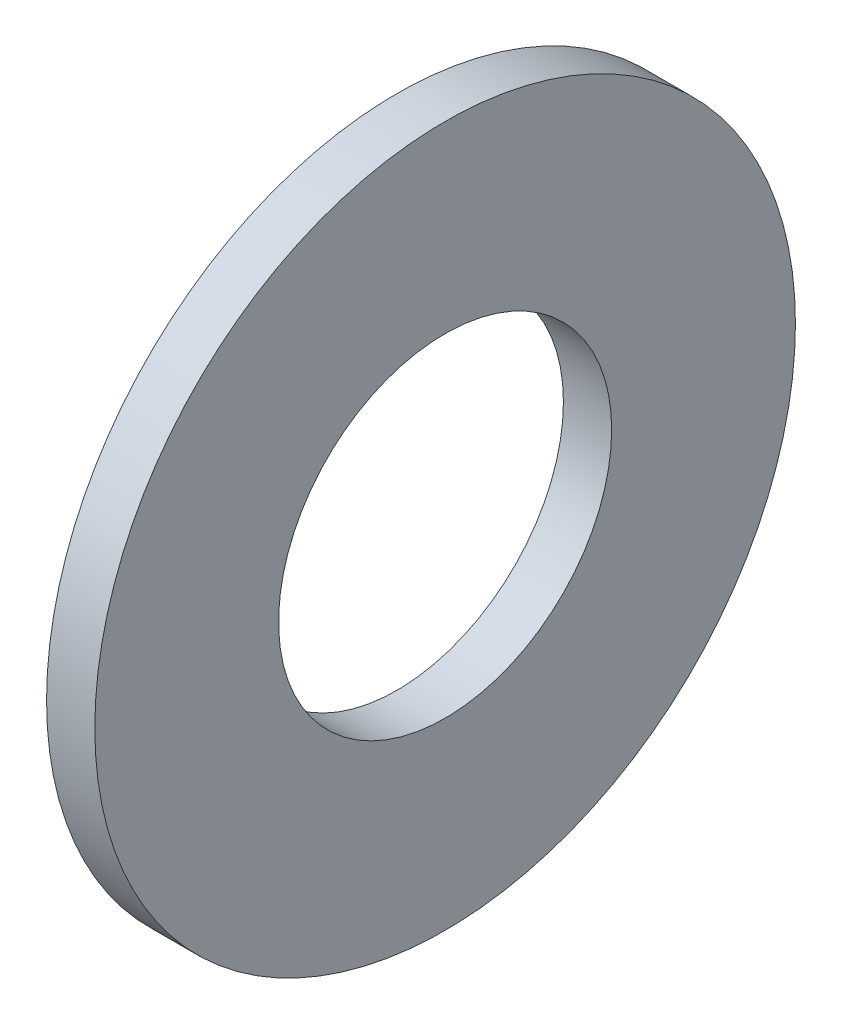
ISO-10303-21;
HEADER;
FILE_DESCRIPTION(('STEP AP214'),'2;1');
FILE_NAME('part.step','',(''),(''),'','','');
FILE_SCHEMA(('AUTOMOTIVE_DESIGN { 1 0 10303 214 1 1 1 1 }'));
ENDSEC;
DATA;
#1=APPLICATION_CONTEXT('core data for automotive mechanical design processes');
#2=APPLICATION_PROTOCOL_DEFINITION('international standard','automotive_design',2000,#1);
#3=PRODUCT_CONTEXT('',#1,'mechanical');
#4=PRODUCT('Part','Part','',(#3));
#5=PRODUCT_RELATED_PRODUCT_CATEGORY('part','',(#4));
#6=PRODUCT_DEFINITION_FORMATION('','',#4);
#7=PRODUCT_DEFINITION_CONTEXT('part definition',#1,'design');
#8=PRODUCT_DEFINITION('design','',#6,#7);
#9=PRODUCT_DEFINITION_SHAPE('','',#8);
#10=(LENGTH_UNIT() NAMED_UNIT(*) SI_UNIT(.MILLI.,.METRE.));
#11=(NAMED_UNIT(*) PLANE_ANGLE_UNIT() SI_UNIT($,.RADIAN.));
#12=(NAMED_UNIT(*) SI_UNIT($,.STERADIAN.) SOLID_ANGLE_UNIT());
#13=UNCERTAINTY_MEASURE_WITH_UNIT(LENGTH_MEASURE(1.E-05),#10,'distance_accuracy_value','');
#14=(GEOMETRIC_REPRESENTATION_CONTEXT(3) GLOBAL_UNCERTAINTY_ASSIGNED_CONTEXT((#13)) GLOBAL_UNIT_ASSIGNED_CONTEXT((#10,
#11,#12)) REPRESENTATION_CONTEXT('',''));
#15=CARTESIAN_POINT('',(0.,0.,0.));
#16=DIRECTION('',(0.,0.,1.));
#17=DIRECTION('',(1.,0.,0.));
#18=AXIS2_PLACEMENT_3D('',#15,#16,#17);
#19=CARTESIAN_POINT('',(-4.2,0.,0.));
#20=DIRECTION('',(1.,0.,0.));
#21=DIRECTION('',(0.,0.,-1.));
#22=AXIS2_PLACEMENT_3D('',#19,#20,#21);
#23=CYLINDRICAL_SURFACE('',#22,30.5);
#24=CARTESIAN_POINT('',(-4.2,0.,0.));
#25=DIRECTION('',(1.,0.,0.));
#26=DIRECTION('',(0.,0.,-1.));
#27=AXIS2_PLACEMENT_3D('',#24,#25,#26);
#28=CIRCLE('',#27,30.5);
#29=CARTESIAN_POINT('',(-4.2,0.,-30.5));
#30=VERTEX_POINT('',#29);
#31=EDGE_CURVE('E10',#30,#30,#28,.T.);
#32=ORIENTED_EDGE('',*,*,#31,.T.);
#33=EDGE_LOOP('',(#32));
#34=FACE_BOUND('',#33,.T.);
#35=CARTESIAN_POINT('',(0.,0.,0.));
#36=DIRECTION('',(1.,0.,0.));
#37=DIRECTION('',(0.,0.,-1.));
#38=AXIS2_PLACEMENT_3D('',#35,#36,#37);
#39=CIRCLE('',#38,30.5);
#40=CARTESIAN_POINT('',(0.,0.,-30.5));
#41=VERTEX_POINT('',#40);
#42=EDGE_CURVE('E46',#41,#41,#39,.T.);
#43=ORIENTED_EDGE('',*,*,#42,.F.);
#44=EDGE_LOOP('',(#43));
#45=FACE_BOUND('',#44,.T.);
#46=ADVANCED_FACE('F43',(#34,#45),#23,.T.);
#47=CARTESIAN_POINT('',(-4.2,0.,0.));
#48=DIRECTION('',(1.,0.,0.));
#49=DIRECTION('',(0.,0.,-1.));
#50=AXIS2_PLACEMENT_3D('',#47,#48,#49);
#51=PLANE('',#50);
#52=CARTESIAN_POINT('',(-4.2,0.,0.));
#53=DIRECTION('',(1.,0.,0.));
#54=DIRECTION('',(0.,0.,-1.));
#55=AXIS2_PLACEMENT_3D('',#52,#53,#54);
#56=CIRCLE('',#55,14.5);
#57=CARTESIAN_POINT('',(-4.2,0.,-14.5));
#58=VERTEX_POINT('',#57);
#59=EDGE_CURVE('E55',#58,#58,#56,.T.);
#60=ORIENTED_EDGE('',*,*,#59,.T.);
#61=EDGE_LOOP('',(#60));
#62=FACE_BOUND('',#61,.T.);
#63=ORIENTED_EDGE('',*,*,#31,.F.);
#64=EDGE_LOOP('',(#63));
#65=FACE_BOUND('',#64,.T.);
#66=ADVANCED_FACE('F65',(#62,#65),#51,.F.);
#67=CARTESIAN_POINT('',(0.,0.,0.));
#68=DIRECTION('',(1.,0.,0.));
#69=DIRECTION('',(0.,0.,-1.));
#70=AXIS2_PLACEMENT_3D('',#67,#68,#69);
#71=PLANE('',#70);
#72=CARTESIAN_POINT('',(0.,0.,0.));
#73=DIRECTION('',(1.,0.,0.));
#74=DIRECTION('',(0.,0.,-1.));
#75=AXIS2_PLACEMENT_3D('',#72,#73,#74);
#76=CIRCLE('',#75,14.5);
#77=CARTESIAN_POINT('',(0.,0.,-14.5));
#78=VERTEX_POINT('',#77);
#79=EDGE_CURVE('E57',#78,#78,#76,.T.);
#80=ORIENTED_EDGE('',*,*,#79,.F.);
#81=EDGE_LOOP('',(#80));
#82=FACE_BOUND('',#81,.T.);
#83=ORIENTED_EDGE('',*,*,#42,.T.);
#84=EDGE_LOOP('',(#83));
#85=FACE_BOUND('',#84,.T.);
#86=ADVANCED_FACE('F71',(#82,#85),#71,.T.);
#87=CARTESIAN_POINT('',(-4.2,0.,0.));
#88=DIRECTION('',(1.,0.,0.));
#89=DIRECTION('',(0.,0.,-1.));
#90=AXIS2_PLACEMENT_3D('',#87,#88,#89);
#91=CYLINDRICAL_SURFACE('',#90,14.5);
#92=ORIENTED_EDGE('',*,*,#59,.F.);
#93=EDGE_LOOP('',(#92));
#94=FACE_BOUND('',#93,.T.);
#95=ORIENTED_EDGE('',*,*,#79,.T.);
#96=EDGE_LOOP('',(#95));
#97=FACE_BOUND('',#96,.T.);
#98=ADVANCED_FACE('F68',(#94,#97),#91,.F.);
#99=CLOSED_SHELL('',(#46,#66,#86,#98));
#100=MANIFOLD_SOLID_BREP('B2',#99);
#101=ADVANCED_BREP_SHAPE_REPRESENTATION('',(#18,#100),#14);
#102=SHAPE_DEFINITION_REPRESENTATION(#9,#101);
ENDSEC;
END-ISO-10303-21;
